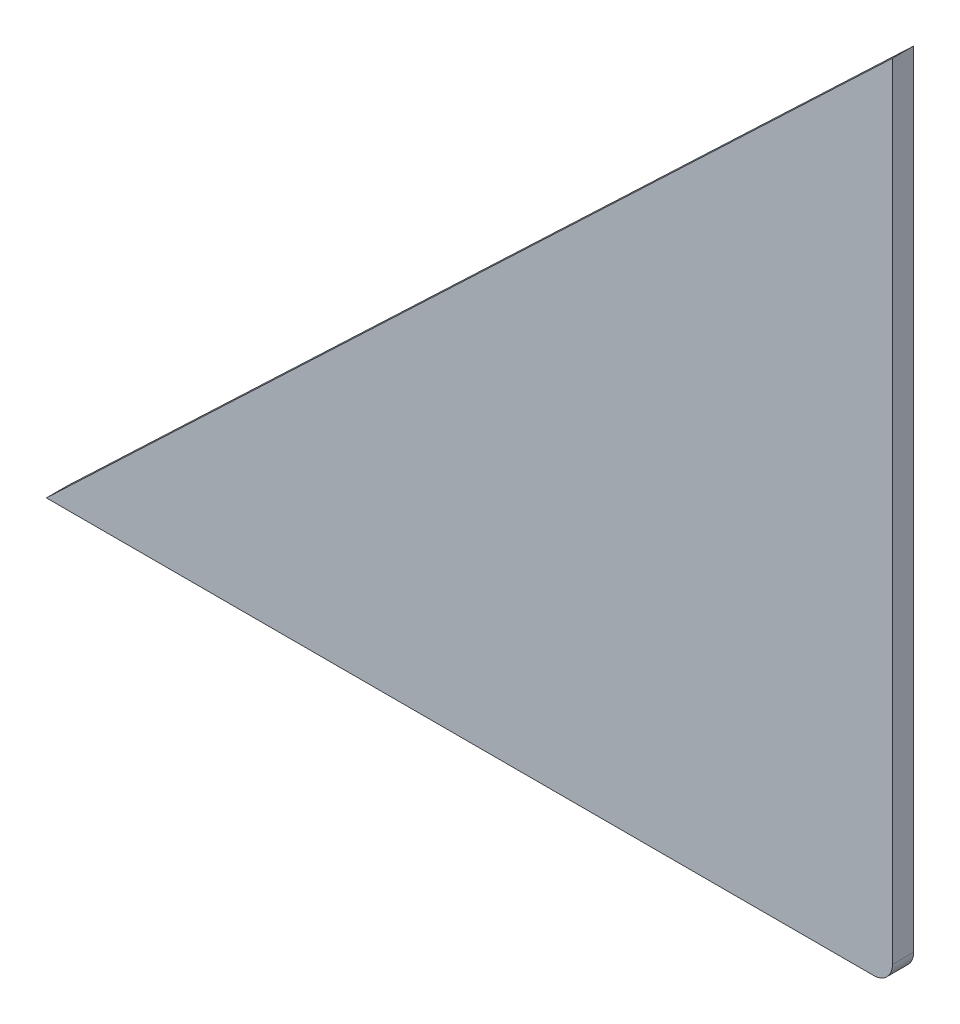
ISO-10303-21;
HEADER;
FILE_DESCRIPTION(('STEP AP214'),'2;1');
FILE_NAME('part.step','',(''),(''),'','','');
FILE_SCHEMA(('AUTOMOTIVE_DESIGN { 1 0 10303 214 1 1 1 1 }'));
ENDSEC;
DATA;
#1=APPLICATION_CONTEXT('core data for automotive mechanical design processes');
#2=APPLICATION_PROTOCOL_DEFINITION('international standard','automotive_design',2000,#1);
#3=PRODUCT_CONTEXT('',#1,'mechanical');
#4=PRODUCT('Part','Part','',(#3));
#5=PRODUCT_RELATED_PRODUCT_CATEGORY('part','',(#4));
#6=PRODUCT_DEFINITION_FORMATION('','',#4);
#7=PRODUCT_DEFINITION_CONTEXT('part definition',#1,'design');
#8=PRODUCT_DEFINITION('design','',#6,#7);
#9=PRODUCT_DEFINITION_SHAPE('','',#8);
#10=(LENGTH_UNIT() NAMED_UNIT(*) SI_UNIT(.MILLI.,.METRE.));
#11=(NAMED_UNIT(*) PLANE_ANGLE_UNIT() SI_UNIT($,.RADIAN.));
#12=(NAMED_UNIT(*) SI_UNIT($,.STERADIAN.) SOLID_ANGLE_UNIT());
#13=UNCERTAINTY_MEASURE_WITH_UNIT(LENGTH_MEASURE(1.E-05),#10,'distance_accuracy_value','');
#14=(GEOMETRIC_REPRESENTATION_CONTEXT(3) GLOBAL_UNCERTAINTY_ASSIGNED_CONTEXT((#13)) GLOBAL_UNIT_ASSIGNED_CONTEXT((#10,
#11,#12)) REPRESENTATION_CONTEXT('',''));
#15=CARTESIAN_POINT('',(0.,0.,0.));
#16=DIRECTION('',(0.,0.,1.));
#17=DIRECTION('',(1.,0.,0.));
#18=AXIS2_PLACEMENT_3D('',#15,#16,#17);
#19=CARTESIAN_POINT('',(0.,76.,1.));
#20=DIRECTION('',(0.688749461914693,-0.724999433594414,0.));
#21=DIRECTION('',(0.724999433594414,0.688749461914693,0.));
#22=AXIS2_PLACEMENT_3D('',#19,#20,#21);
#23=PLANE('',#22);
#24=DIRECTION('',(-0.724999433594414,-0.688749461914693,0.));
#25=VECTOR('',#24,1.);
#26=CARTESIAN_POINT('',(0.,76.,-1.));
#27=LINE('',#26,#25);
#28=CARTESIAN_POINT('',(0.,76.,-1.));
#29=VERTEX_POINT('',#28);
#30=CARTESIAN_POINT('',(-80.,0.,-1.));
#31=VERTEX_POINT('',#30);
#32=EDGE_CURVE('E102',#29,#31,#27,.T.);
#33=ORIENTED_EDGE('',*,*,#32,.T.);
#34=DIRECTION('',(0.,0.,-1.));
#35=VECTOR('',#34,1.);
#36=CARTESIAN_POINT('',(-80.,0.,1.));
#37=LINE('',#36,#35);
#38=CARTESIAN_POINT('',(-80.,0.,1.));
#39=VERTEX_POINT('',#38);
#40=EDGE_CURVE('E11',#39,#31,#37,.T.);
#41=ORIENTED_EDGE('',*,*,#40,.F.);
#42=DIRECTION('',(-0.724999433594414,-0.688749461914693,0.));
#43=VECTOR('',#42,1.);
#44=CARTESIAN_POINT('',(0.,76.,1.));
#45=LINE('',#44,#43);
#46=CARTESIAN_POINT('',(0.,76.,1.));
#47=VERTEX_POINT('',#46);
#48=EDGE_CURVE('E90',#47,#39,#45,.T.);
#49=ORIENTED_EDGE('',*,*,#48,.F.);
#50=DIRECTION('',(0.,0.,-1.));
#51=VECTOR('',#50,1.);
#52=CARTESIAN_POINT('',(0.,76.,1.));
#53=LINE('',#52,#51);
#54=EDGE_CURVE('E98',#47,#29,#53,.T.);
#55=ORIENTED_EDGE('',*,*,#54,.T.);
#56=EDGE_LOOP('',(#33,#41,#49,#55));
#57=FACE_BOUND('',#56,.T.);
#58=ADVANCED_FACE('F39',(#57),#23,.F.);
#59=CARTESIAN_POINT('',(-80.,0.,1.));
#60=DIRECTION('',(0.,1.,0.));
#61=DIRECTION('',(0.,0.,1.));
#62=AXIS2_PLACEMENT_3D('',#59,#60,#61);
#63=PLANE('',#62);
#64=DIRECTION('',(1.,0.,0.));
#65=VECTOR('',#64,1.);
#66=CARTESIAN_POINT('',(-80.,0.,-1.));
#67=LINE('',#66,#65);
#68=CARTESIAN_POINT('',(-1.8,0.,-1.));
#69=VERTEX_POINT('',#68);
#70=EDGE_CURVE('E94',#31,#69,#67,.T.);
#71=ORIENTED_EDGE('',*,*,#70,.T.);
#72=DIRECTION('',(0.,0.,-1.));
#73=VECTOR('',#72,1.);
#74=CARTESIAN_POINT('',(-1.8,0.,1.));
#75=LINE('',#74,#73);
#76=CARTESIAN_POINT('',(-1.8,0.,1.));
#77=VERTEX_POINT('',#76);
#78=EDGE_CURVE('E47',#77,#69,#75,.T.);
#79=ORIENTED_EDGE('',*,*,#78,.F.);
#80=DIRECTION('',(1.,0.,0.));
#81=VECTOR('',#80,1.);
#82=CARTESIAN_POINT('',(-80.,0.,1.));
#83=LINE('',#82,#81);
#84=EDGE_CURVE('E85',#39,#77,#83,.T.);
#85=ORIENTED_EDGE('',*,*,#84,.F.);
#86=ORIENTED_EDGE('',*,*,#40,.T.);
#87=EDGE_LOOP('',(#71,#79,#85,#86));
#88=FACE_BOUND('',#87,.T.);
#89=ADVANCED_FACE('F93',(#88),#63,.F.);
#90=CARTESIAN_POINT('',(-1.8,1.8,1.));
#91=DIRECTION('',(0.,0.,-1.));
#92=DIRECTION('',(-1.,0.,0.));
#93=AXIS2_PLACEMENT_3D('',#90,#91,#92);
#94=CYLINDRICAL_SURFACE('',#93,1.8);
#95=CARTESIAN_POINT('',(-1.8,1.8,-1.));
#96=DIRECTION('',(0.,0.,1.));
#97=DIRECTION('',(-1.,0.,0.));
#98=AXIS2_PLACEMENT_3D('',#95,#96,#97);
#99=CIRCLE('',#98,1.8);
#100=CARTESIAN_POINT('',(0.,1.8,-1.));
#101=VERTEX_POINT('',#100);
#102=EDGE_CURVE('E72',#69,#101,#99,.T.);
#103=ORIENTED_EDGE('',*,*,#102,.T.);
#104=DIRECTION('',(0.,0.,-1.));
#105=VECTOR('',#104,1.);
#106=CARTESIAN_POINT('',(0.,1.8,1.));
#107=LINE('',#106,#105);
#108=CARTESIAN_POINT('',(0.,1.8,1.));
#109=VERTEX_POINT('',#108);
#110=EDGE_CURVE('E95',#109,#101,#107,.T.);
#111=ORIENTED_EDGE('',*,*,#110,.F.);
#112=CARTESIAN_POINT('',(-1.8,1.8,1.));
#113=DIRECTION('',(0.,0.,1.));
#114=DIRECTION('',(-1.,0.,0.));
#115=AXIS2_PLACEMENT_3D('',#112,#113,#114);
#116=CIRCLE('',#115,1.8);
#117=EDGE_CURVE('E88',#77,#109,#116,.T.);
#118=ORIENTED_EDGE('',*,*,#117,.F.);
#119=ORIENTED_EDGE('',*,*,#78,.T.);
#120=EDGE_LOOP('',(#103,#111,#118,#119));
#121=FACE_BOUND('',#120,.T.);
#122=ADVANCED_FACE('F96',(#121),#94,.T.);
#123=CARTESIAN_POINT('',(0.,1.8,1.));
#124=DIRECTION('',(-1.,0.,0.));
#125=DIRECTION('',(0.,0.,1.));
#126=AXIS2_PLACEMENT_3D('',#123,#124,#125);
#127=PLANE('',#126);
#128=DIRECTION('',(0.,1.,0.));
#129=VECTOR('',#128,1.);
#130=CARTESIAN_POINT('',(0.,1.8,-1.));
#131=LINE('',#130,#129);
#132=EDGE_CURVE('E78',#101,#29,#131,.T.);
#133=ORIENTED_EDGE('',*,*,#132,.T.);
#134=ORIENTED_EDGE('',*,*,#54,.F.);
#135=DIRECTION('',(0.,1.,0.));
#136=VECTOR('',#135,1.);
#137=CARTESIAN_POINT('',(0.,1.8,1.));
#138=LINE('',#137,#136);
#139=EDGE_CURVE('E55',#109,#47,#138,.T.);
#140=ORIENTED_EDGE('',*,*,#139,.F.);
#141=ORIENTED_EDGE('',*,*,#110,.T.);
#142=EDGE_LOOP('',(#133,#134,#140,#141));
#143=FACE_BOUND('',#142,.T.);
#144=ADVANCED_FACE('F109',(#143),#127,.F.);
#145=CARTESIAN_POINT('',(-1.8,1.8,1.));
#146=DIRECTION('',(0.,0.,-1.));
#147=DIRECTION('',(-1.,0.,0.));
#148=AXIS2_PLACEMENT_3D('',#145,#146,#147);
#149=PLANE('',#148);
#150=ORIENTED_EDGE('',*,*,#48,.T.);
#151=ORIENTED_EDGE('',*,*,#84,.T.);
#152=ORIENTED_EDGE('',*,*,#117,.T.);
#153=ORIENTED_EDGE('',*,*,#139,.T.);
#154=EDGE_LOOP('',(#150,#151,#152,#153));
#155=FACE_BOUND('',#154,.T.);
#156=ADVANCED_FACE('F86',(#155),#149,.F.);
#157=CARTESIAN_POINT('',(-1.8,1.8,-1.));
#158=DIRECTION('',(0.,0.,-1.));
#159=DIRECTION('',(-1.,0.,0.));
#160=AXIS2_PLACEMENT_3D('',#157,#158,#159);
#161=PLANE('',#160);
#162=ORIENTED_EDGE('',*,*,#32,.F.);
#163=ORIENTED_EDGE('',*,*,#132,.F.);
#164=ORIENTED_EDGE('',*,*,#102,.F.);
#165=ORIENTED_EDGE('',*,*,#70,.F.);
#166=EDGE_LOOP('',(#162,#163,#164,#165));
#167=FACE_BOUND('',#166,.T.);
#168=ADVANCED_FACE('F112',(#167),#161,.T.);
#169=CLOSED_SHELL('',(#58,#89,#122,#144,#156,#168));
#170=MANIFOLD_SOLID_BREP('B2',#169);
#171=ADVANCED_BREP_SHAPE_REPRESENTATION('',(#18,#170),#14);
#172=SHAPE_DEFINITION_REPRESENTATION(#9,#171);
ENDSEC;
END-ISO-10303-21;
